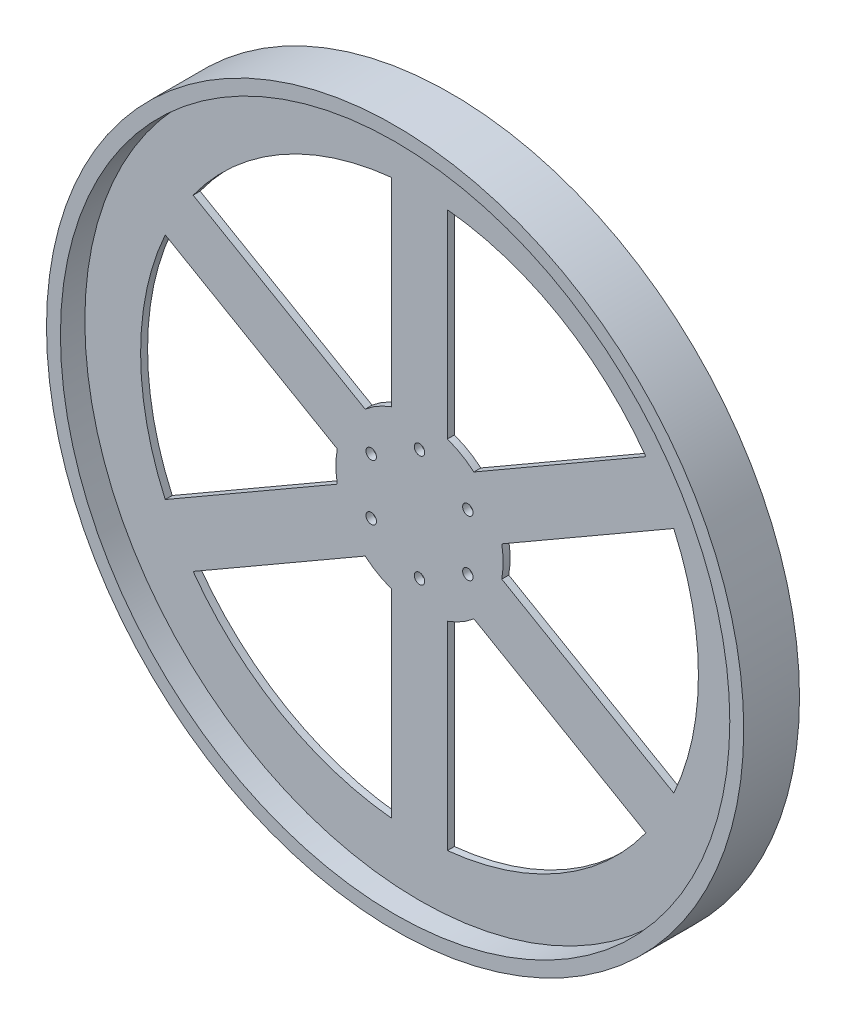
ISO-10303-21;
HEADER;
FILE_DESCRIPTION(('STEP AP214'),'2;1');
FILE_NAME('part.step','',(''),(''),'','','');
FILE_SCHEMA(('AUTOMOTIVE_DESIGN { 1 0 10303 214 1 1 1 1 }'));
ENDSEC;
DATA;
#1=APPLICATION_CONTEXT('core data for automotive mechanical design processes');
#2=APPLICATION_PROTOCOL_DEFINITION('international standard','automotive_design',2000,#1);
#3=PRODUCT_CONTEXT('',#1,'mechanical');
#4=PRODUCT('Part','Part','',(#3));
#5=PRODUCT_RELATED_PRODUCT_CATEGORY('part','',(#4));
#6=PRODUCT_DEFINITION_FORMATION('','',#4);
#7=PRODUCT_DEFINITION_CONTEXT('part definition',#1,'design');
#8=PRODUCT_DEFINITION('design','',#6,#7);
#9=PRODUCT_DEFINITION_SHAPE('','',#8);
#10=(LENGTH_UNIT() NAMED_UNIT(*) SI_UNIT(.MILLI.,.METRE.));
#11=(NAMED_UNIT(*) PLANE_ANGLE_UNIT() SI_UNIT($,.RADIAN.));
#12=(NAMED_UNIT(*) SI_UNIT($,.STERADIAN.) SOLID_ANGLE_UNIT());
#13=UNCERTAINTY_MEASURE_WITH_UNIT(LENGTH_MEASURE(1.E-05),#10,'distance_accuracy_value','');
#14=(GEOMETRIC_REPRESENTATION_CONTEXT(3) GLOBAL_UNCERTAINTY_ASSIGNED_CONTEXT((#13)) GLOBAL_UNIT_ASSIGNED_CONTEXT((#10,
#11,#12)) REPRESENTATION_CONTEXT('',''));
#15=CARTESIAN_POINT('',(0.,0.,0.));
#16=DIRECTION('',(0.,0.,1.));
#17=DIRECTION('',(1.,0.,0.));
#18=AXIS2_PLACEMENT_3D('',#15,#16,#17);
#19=CARTESIAN_POINT('',(0.,0.,-3.175));
#20=DIRECTION('',(0.,0.,1.));
#21=DIRECTION('',(1.,0.,0.));
#22=AXIS2_PLACEMENT_3D('',#19,#20,#21);
#23=CYLINDRICAL_SURFACE('',#22,76.2);
#24=DIRECTION('',(0.,0.,1.));
#25=VECTOR('',#24,1.);
#26=CARTESIAN_POINT('',(-74.9170394666928,-13.9239792281517,-3.175));
#27=LINE('',#26,#25);
#28=CARTESIAN_POINT('',(-74.9170394666928,-13.9239792281517,-3.175));
#29=VERTEX_POINT('',#28);
#30=CARTESIAN_POINT('',(-74.9170394666928,-13.9239792281517,3.175));
#31=VERTEX_POINT('',#30);
#32=EDGE_CURVE('E331',#29,#31,#27,.T.);
#33=ORIENTED_EDGE('',*,*,#32,.T.);
#34=CARTESIAN_POINT('',(0.,0.,3.175));
#35=DIRECTION('',(0.,0.,1.));
#36=DIRECTION('',(1.,0.,0.));
#37=AXIS2_PLACEMENT_3D('',#34,#35,#36);
#38=CIRCLE('',#37,76.2);
#39=CARTESIAN_POINT('',(-74.9170394666927,13.9239792281522,3.175));
#40=VERTEX_POINT('',#39);
#41=EDGE_CURVE('E245',#40,#31,#38,.T.);
#42=ORIENTED_EDGE('',*,*,#41,.F.);
#43=DIRECTION('',(0.,0.,1.));
#44=VECTOR('',#43,1.);
#45=CARTESIAN_POINT('',(-74.9170394666927,13.9239792281522,-3.175));
#46=LINE('',#45,#44);
#47=CARTESIAN_POINT('',(-74.9170394666927,13.9239792281522,-3.175));
#48=VERTEX_POINT('',#47);
#49=EDGE_CURVE('E12',#48,#40,#46,.T.);
#50=ORIENTED_EDGE('',*,*,#49,.F.);
#51=CARTESIAN_POINT('',(0.,0.,-3.175));
#52=DIRECTION('',(0.,0.,1.));
#53=DIRECTION('',(1.,0.,0.));
#54=AXIS2_PLACEMENT_3D('',#51,#52,#53);
#55=CIRCLE('',#54,76.2);
#56=EDGE_CURVE('E294',#48,#29,#55,.T.);
#57=ORIENTED_EDGE('',*,*,#56,.T.);
#58=EDGE_LOOP('',(#33,#42,#50,#57));
#59=FACE_BOUND('',#58,.T.);
#60=ADVANCED_FACE('F41',(#59),#23,.T.);
#61=CARTESIAN_POINT('',(-12.7000000000001,-21.9970452561247,-3.175));
#62=DIRECTION('',(0.500000000000004,0.866025403784436,0.));
#63=DIRECTION('',(-0.866025403784437,0.500000000000004,0.));
#64=AXIS2_PLACEMENT_3D('',#61,#62,#63);
#65=PLANE('',#64);
#66=ORIENTED_EDGE('',*,*,#49,.T.);
#67=DIRECTION('',(-0.866025403784436,0.500000000000004,0.));
#68=VECTOR('',#67,1.);
#69=CARTESIAN_POINT('',(-12.7000000000001,-21.9970452561247,3.175));
#70=LINE('',#69,#68);
#71=CARTESIAN_POINT('',(-231.567836833098,104.366359256417,3.175));
#72=VERTEX_POINT('',#71);
#73=EDGE_CURVE('E275',#40,#72,#70,.T.);
#74=ORIENTED_EDGE('',*,*,#73,.T.);
#75=DIRECTION('',(0.,0.,1.));
#76=VECTOR('',#75,1.);
#77=CARTESIAN_POINT('',(-231.567836833098,104.366359256417,-3.175));
#78=LINE('',#77,#76);
#79=CARTESIAN_POINT('',(-231.567836833098,104.366359256417,-3.175));
#80=VERTEX_POINT('',#79);
#81=EDGE_CURVE('E50',#80,#72,#78,.T.);
#82=ORIENTED_EDGE('',*,*,#81,.F.);
#83=DIRECTION('',(-0.866025403784436,0.500000000000004,0.));
#84=VECTOR('',#83,1.);
#85=CARTESIAN_POINT('',(-12.7000000000001,-21.9970452561247,-3.175));
#86=LINE('',#85,#84);
#87=EDGE_CURVE('E324',#48,#80,#86,.T.);
#88=ORIENTED_EDGE('',*,*,#87,.F.);
#89=EDGE_LOOP('',(#66,#74,#82,#88));
#90=FACE_BOUND('',#89,.T.);
#91=ADVANCED_FACE('F423',(#90),#65,.F.);
#92=CARTESIAN_POINT('',(0.,0.,-3.175));
#93=DIRECTION('',(0.,0.,1.));
#94=DIRECTION('',(1.,0.,0.));
#95=AXIS2_PLACEMENT_3D('',#92,#93,#94);
#96=CYLINDRICAL_SURFACE('',#95,254.);
#97=ORIENTED_EDGE('',*,*,#81,.T.);
#98=CARTESIAN_POINT('',(0.,0.,3.175));
#99=DIRECTION('',(0.,0.,1.));
#100=DIRECTION('',(1.,0.,0.));
#101=AXIS2_PLACEMENT_3D('',#98,#99,#100);
#102=CIRCLE('',#101,254.);
#103=CARTESIAN_POINT('',(-231.567836833099,-104.366359256416,3.175));
#104=VERTEX_POINT('',#103);
#105=EDGE_CURVE('E237',#72,#104,#102,.T.);
#106=ORIENTED_EDGE('',*,*,#105,.T.);
#107=DIRECTION('',(0.,0.,1.));
#108=VECTOR('',#107,1.);
#109=CARTESIAN_POINT('',(-231.567836833099,-104.366359256416,-3.175));
#110=LINE('',#109,#108);
#111=CARTESIAN_POINT('',(-231.567836833099,-104.366359256416,-3.175));
#112=VERTEX_POINT('',#111);
#113=EDGE_CURVE('E329',#112,#104,#110,.T.);
#114=ORIENTED_EDGE('',*,*,#113,.F.);
#115=CARTESIAN_POINT('',(0.,0.,-3.175));
#116=DIRECTION('',(0.,0.,1.));
#117=DIRECTION('',(1.,0.,0.));
#118=AXIS2_PLACEMENT_3D('',#115,#116,#117);
#119=CIRCLE('',#118,254.);
#120=EDGE_CURVE('E64',#80,#112,#119,.T.);
#121=ORIENTED_EDGE('',*,*,#120,.F.);
#122=EDGE_LOOP('',(#97,#106,#114,#121));
#123=FACE_BOUND('',#122,.T.);
#124=ADVANCED_FACE('F430',(#123),#96,.F.);
#125=CARTESIAN_POINT('',(-25.4,1.70513996829964E-13,-3.175));
#126=DIRECTION('',(1.,0.,0.));
#127=DIRECTION('',(0.,1.,0.));
#128=AXIS2_PLACEMENT_3D('',#125,#126,#127);
#129=PLANE('',#128);
#130=DIRECTION('',(0.,0.,1.));
#131=VECTOR('',#130,1.);
#132=CARTESIAN_POINT('',(-25.3999999999996,71.8420489685534,-3.175));
#133=LINE('',#132,#131);
#134=CARTESIAN_POINT('',(-25.3999999999996,71.8420489685534,-3.175));
#135=VERTEX_POINT('',#134);
#136=CARTESIAN_POINT('',(-25.3999999999996,71.8420489685534,3.175));
#137=VERTEX_POINT('',#136);
#138=EDGE_CURVE('E339',#135,#137,#133,.T.);
#139=ORIENTED_EDGE('',*,*,#138,.T.);
#140=DIRECTION('',(0.,1.,0.));
#141=VECTOR('',#140,1.);
#142=CARTESIAN_POINT('',(-25.4,1.70513996829964E-13,3.175));
#143=LINE('',#142,#141);
#144=CARTESIAN_POINT('',(-25.3999999999983,252.726809025082,3.175));
#145=VERTEX_POINT('',#144);
#146=EDGE_CURVE('E264',#137,#145,#143,.T.);
#147=ORIENTED_EDGE('',*,*,#146,.T.);
#148=DIRECTION('',(0.,0.,1.));
#149=VECTOR('',#148,1.);
#150=CARTESIAN_POINT('',(-25.3999999999983,252.726809025082,-3.175));
#151=LINE('',#150,#149);
#152=CARTESIAN_POINT('',(-25.3999999999983,252.726809025082,-3.175));
#153=VERTEX_POINT('',#152);
#154=EDGE_CURVE('E333',#153,#145,#151,.T.);
#155=ORIENTED_EDGE('',*,*,#154,.F.);
#156=DIRECTION('',(0.,1.,0.));
#157=VECTOR('',#156,1.);
#158=CARTESIAN_POINT('',(-25.4,1.70513996829964E-13,-3.175));
#159=LINE('',#158,#157);
#160=EDGE_CURVE('E313',#135,#153,#159,.T.);
#161=ORIENTED_EDGE('',*,*,#160,.F.);
#162=EDGE_LOOP('',(#139,#147,#155,#161));
#163=FACE_BOUND('',#162,.T.);
#164=ADVANCED_FACE('F524',(#163),#129,.F.);
#165=ORIENTED_EDGE('',*,*,#154,.T.);
#166=CARTESIAN_POINT('',(-206.167836833098,148.360449768666,3.175));
#167=VERTEX_POINT('',#166);
#168=EDGE_CURVE('E271',#145,#167,#102,.T.);
#169=ORIENTED_EDGE('',*,*,#168,.T.);
#170=DIRECTION('',(0.,0.,1.));
#171=VECTOR('',#170,1.);
#172=CARTESIAN_POINT('',(-206.167836833098,148.360449768666,-3.175));
#173=LINE('',#172,#171);
#174=CARTESIAN_POINT('',(-206.167836833098,148.360449768666,-3.175));
#175=VERTEX_POINT('',#174);
#176=EDGE_CURVE('E335',#175,#167,#173,.T.);
#177=ORIENTED_EDGE('',*,*,#176,.F.);
#178=EDGE_CURVE('E320',#153,#175,#119,.T.);
#179=ORIENTED_EDGE('',*,*,#178,.F.);
#180=EDGE_LOOP('',(#165,#169,#177,#179));
#181=FACE_BOUND('',#180,.T.);
#182=ADVANCED_FACE('F515',(#181),#96,.F.);
#183=CARTESIAN_POINT('',(12.7000000000001,21.9970452561247,-3.175));
#184=DIRECTION('',(0.500000000000004,0.866025403784436,0.));
#185=DIRECTION('',(-0.866025403784437,0.500000000000004,0.));
#186=AXIS2_PLACEMENT_3D('',#183,#184,#185);
#187=PLANE('',#186);
#188=ORIENTED_EDGE('',*,*,#176,.T.);
#189=DIRECTION('',(-0.866025403784437,0.500000000000004,0.));
#190=VECTOR('',#189,1.);
#191=CARTESIAN_POINT('',(12.7000000000001,21.9970452561247,3.175));
#192=LINE('',#191,#190);
#193=CARTESIAN_POINT('',(-49.5170394666925,57.9180697404016,3.175));
#194=VERTEX_POINT('',#193);
#195=EDGE_CURVE('E268',#194,#167,#192,.T.);
#196=ORIENTED_EDGE('',*,*,#195,.F.);
#197=DIRECTION('',(0.,0.,1.));
#198=VECTOR('',#197,1.);
#199=CARTESIAN_POINT('',(-49.5170394666925,57.9180697404016,-3.175));
#200=LINE('',#199,#198);
#201=CARTESIAN_POINT('',(-49.5170394666925,57.9180697404016,-3.175));
#202=VERTEX_POINT('',#201);
#203=EDGE_CURVE('E337',#202,#194,#200,.T.);
#204=ORIENTED_EDGE('',*,*,#203,.F.);
#205=DIRECTION('',(-0.866025403784437,0.500000000000004,0.));
#206=VECTOR('',#205,1.);
#207=CARTESIAN_POINT('',(12.7000000000001,21.9970452561247,-3.175));
#208=LINE('',#207,#206);
#209=EDGE_CURVE('E317',#202,#175,#208,.T.);
#210=ORIENTED_EDGE('',*,*,#209,.T.);
#211=EDGE_LOOP('',(#188,#196,#204,#210));
#212=FACE_BOUND('',#211,.T.);
#213=ADVANCED_FACE('F455',(#212),#187,.T.);
#214=CARTESIAN_POINT('',(-12.6999999999998,21.9970452561249,-3.175));
#215=DIRECTION('',(0.499999999999992,-0.866025403784443,0.));
#216=DIRECTION('',(0.866025403784443,0.499999999999992,0.));
#217=AXIS2_PLACEMENT_3D('',#214,#215,#216);
#218=PLANE('',#217);
#219=DIRECTION('',(0.,0.,1.));
#220=VECTOR('',#219,1.);
#221=CARTESIAN_POINT('',(49.5170394666932,57.9180697404009,-3.175));
#222=LINE('',#221,#220);
#223=CARTESIAN_POINT('',(49.5170394666932,57.9180697404009,-3.175));
#224=VERTEX_POINT('',#223);
#225=CARTESIAN_POINT('',(49.5170394666932,57.9180697404009,3.175));
#226=VERTEX_POINT('',#225);
#227=EDGE_CURVE('E347',#224,#226,#222,.T.);
#228=ORIENTED_EDGE('',*,*,#227,.T.);
#229=DIRECTION('',(0.866025403784443,0.499999999999992,0.));
#230=VECTOR('',#229,1.);
#231=CARTESIAN_POINT('',(-12.6999999999998,21.9970452561249,3.175));
#232=LINE('',#231,#230);
#233=CARTESIAN_POINT('',(206.1678368331,148.360449768664,3.175));
#234=VERTEX_POINT('',#233);
#235=EDGE_CURVE('E256',#226,#234,#232,.T.);
#236=ORIENTED_EDGE('',*,*,#235,.T.);
#237=DIRECTION('',(0.,0.,1.));
#238=VECTOR('',#237,1.);
#239=CARTESIAN_POINT('',(206.1678368331,148.360449768664,-3.175));
#240=LINE('',#239,#238);
#241=CARTESIAN_POINT('',(206.1678368331,148.360449768664,-3.175));
#242=VERTEX_POINT('',#241);
#243=EDGE_CURVE('E341',#242,#234,#240,.T.);
#244=ORIENTED_EDGE('',*,*,#243,.F.);
#245=DIRECTION('',(0.866025403784443,0.499999999999992,0.));
#246=VECTOR('',#245,1.);
#247=CARTESIAN_POINT('',(-12.6999999999998,21.9970452561249,-3.175));
#248=LINE('',#247,#246);
#249=EDGE_CURVE('E305',#224,#242,#248,.T.);
#250=ORIENTED_EDGE('',*,*,#249,.F.);
#251=EDGE_LOOP('',(#228,#236,#244,#250));
#252=FACE_BOUND('',#251,.T.);
#253=ADVANCED_FACE('F510',(#252),#218,.F.);
#254=ORIENTED_EDGE('',*,*,#243,.T.);
#255=CARTESIAN_POINT('',(25.4000000000016,252.726809025081,3.175));
#256=VERTEX_POINT('',#255);
#257=EDGE_CURVE('E263',#234,#256,#102,.T.);
#258=ORIENTED_EDGE('',*,*,#257,.T.);
#259=DIRECTION('',(0.,0.,1.));
#260=VECTOR('',#259,1.);
#261=CARTESIAN_POINT('',(25.4000000000016,252.726809025081,-3.175));
#262=LINE('',#261,#260);
#263=CARTESIAN_POINT('',(25.4000000000016,252.726809025081,-3.175));
#264=VERTEX_POINT('',#263);
#265=EDGE_CURVE('E343',#264,#256,#262,.T.);
#266=ORIENTED_EDGE('',*,*,#265,.F.);
#267=EDGE_CURVE('E312',#242,#264,#119,.T.);
#268=ORIENTED_EDGE('',*,*,#267,.F.);
#269=EDGE_LOOP('',(#254,#258,#266,#268));
#270=FACE_BOUND('',#269,.T.);
#271=ADVANCED_FACE('F512',(#270),#96,.F.);
#272=CARTESIAN_POINT('',(25.4,-1.60770339868252E-13,-3.175));
#273=DIRECTION('',(1.,0.,0.));
#274=DIRECTION('',(0.,1.,0.));
#275=AXIS2_PLACEMENT_3D('',#272,#273,#274);
#276=PLANE('',#275);
#277=ORIENTED_EDGE('',*,*,#265,.T.);
#278=DIRECTION('',(0.,1.,0.));
#279=VECTOR('',#278,1.);
#280=CARTESIAN_POINT('',(25.4,-1.60770339868252E-13,3.175));
#281=LINE('',#280,#279);
#282=CARTESIAN_POINT('',(25.4000000000005,71.8420489685531,3.175));
#283=VERTEX_POINT('',#282);
#284=EDGE_CURVE('E260',#283,#256,#281,.T.);
#285=ORIENTED_EDGE('',*,*,#284,.F.);
#286=DIRECTION('',(0.,0.,1.));
#287=VECTOR('',#286,1.);
#288=CARTESIAN_POINT('',(25.4000000000005,71.8420489685531,-3.175));
#289=LINE('',#288,#287);
#290=CARTESIAN_POINT('',(25.4000000000005,71.8420489685531,-3.175));
#291=VERTEX_POINT('',#290);
#292=EDGE_CURVE('E345',#291,#283,#289,.T.);
#293=ORIENTED_EDGE('',*,*,#292,.F.);
#294=DIRECTION('',(0.,1.,0.));
#295=VECTOR('',#294,1.);
#296=CARTESIAN_POINT('',(25.4,-1.60770339868252E-13,-3.175));
#297=LINE('',#296,#295);
#298=EDGE_CURVE('E309',#291,#264,#297,.T.);
#299=ORIENTED_EDGE('',*,*,#298,.T.);
#300=EDGE_LOOP('',(#277,#285,#293,#299));
#301=FACE_BOUND('',#300,.T.);
#302=ADVANCED_FACE('F506',(#301),#276,.T.);
#303=CARTESIAN_POINT('',(12.7,21.9970452561248,-3.175));
#304=DIRECTION('',(-0.499999999999998,-0.86602540378444,0.));
#305=DIRECTION('',(0.86602540378444,-0.499999999999998,0.));
#306=AXIS2_PLACEMENT_3D('',#303,#304,#305);
#307=PLANE('',#306);
#308=DIRECTION('',(0.,0.,1.));
#309=VECTOR('',#308,1.);
#310=CARTESIAN_POINT('',(74.9170394666928,-13.9239792281516,-3.175));
#311=LINE('',#310,#309);
#312=CARTESIAN_POINT('',(74.9170394666928,-13.9239792281516,-3.175));
#313=VERTEX_POINT('',#312);
#314=CARTESIAN_POINT('',(74.9170394666928,-13.9239792281516,3.175));
#315=VERTEX_POINT('',#314);
#316=EDGE_CURVE('E355',#313,#315,#311,.T.);
#317=ORIENTED_EDGE('',*,*,#316,.T.);
#318=DIRECTION('',(0.86602540378444,-0.499999999999998,0.));
#319=VECTOR('',#318,1.);
#320=CARTESIAN_POINT('',(12.7,21.9970452561248,3.175));
#321=LINE('',#320,#319);
#322=CARTESIAN_POINT('',(231.567836833099,-104.366359256415,3.175));
#323=VERTEX_POINT('',#322);
#324=EDGE_CURVE('E249',#315,#323,#321,.T.);
#325=ORIENTED_EDGE('',*,*,#324,.T.);
#326=DIRECTION('',(0.,0.,1.));
#327=VECTOR('',#326,1.);
#328=CARTESIAN_POINT('',(231.567836833099,-104.366359256415,-3.175));
#329=LINE('',#328,#327);
#330=CARTESIAN_POINT('',(231.567836833099,-104.366359256415,-3.175));
#331=VERTEX_POINT('',#330);
#332=EDGE_CURVE('E349',#331,#323,#329,.T.);
#333=ORIENTED_EDGE('',*,*,#332,.F.);
#334=DIRECTION('',(0.86602540378444,-0.499999999999998,0.));
#335=VECTOR('',#334,1.);
#336=CARTESIAN_POINT('',(12.7,21.9970452561248,-3.175));
#337=LINE('',#336,#335);
#338=EDGE_CURVE('E298',#313,#331,#337,.T.);
#339=ORIENTED_EDGE('',*,*,#338,.F.);
#340=EDGE_LOOP('',(#317,#325,#333,#339));
#341=FACE_BOUND('',#340,.T.);
#342=ADVANCED_FACE('F520',(#341),#307,.F.);
#343=ORIENTED_EDGE('',*,*,#332,.T.);
#344=CARTESIAN_POINT('',(231.5678368331,104.366359256414,3.175));
#345=VERTEX_POINT('',#344);
#346=EDGE_CURVE('E255',#323,#345,#102,.T.);
#347=ORIENTED_EDGE('',*,*,#346,.T.);
#348=DIRECTION('',(0.,0.,1.));
#349=VECTOR('',#348,1.);
#350=CARTESIAN_POINT('',(231.5678368331,104.366359256414,-3.175));
#351=LINE('',#350,#349);
#352=CARTESIAN_POINT('',(231.5678368331,104.366359256414,-3.175));
#353=VERTEX_POINT('',#352);
#354=EDGE_CURVE('E351',#353,#345,#351,.T.);
#355=ORIENTED_EDGE('',*,*,#354,.F.);
#356=EDGE_CURVE('E304',#331,#353,#119,.T.);
#357=ORIENTED_EDGE('',*,*,#356,.F.);
#358=EDGE_LOOP('',(#343,#347,#355,#357));
#359=FACE_BOUND('',#358,.T.);
#360=ADVANCED_FACE('F492',(#359),#96,.F.);
#361=CARTESIAN_POINT('',(12.6999999999998,-21.9970452561249,-3.175));
#362=DIRECTION('',(0.499999999999992,-0.866025403784443,0.));
#363=DIRECTION('',(0.866025403784443,0.499999999999993,0.));
#364=AXIS2_PLACEMENT_3D('',#361,#362,#363);
#365=PLANE('',#364);
#366=ORIENTED_EDGE('',*,*,#354,.T.);
#367=DIRECTION('',(0.866025403784443,0.499999999999993,0.));
#368=VECTOR('',#367,1.);
#369=CARTESIAN_POINT('',(12.6999999999998,-21.9970452561249,3.175));
#370=LINE('',#369,#368);
#371=CARTESIAN_POINT('',(74.9170394666929,13.9239792281512,3.175));
#372=VERTEX_POINT('',#371);
#373=EDGE_CURVE('E252',#372,#345,#370,.T.);
#374=ORIENTED_EDGE('',*,*,#373,.F.);
#375=DIRECTION('',(0.,0.,1.));
#376=VECTOR('',#375,1.);
#377=CARTESIAN_POINT('',(74.9170394666929,13.9239792281512,-3.175));
#378=LINE('',#377,#376);
#379=CARTESIAN_POINT('',(74.9170394666929,13.9239792281512,-3.175));
#380=VERTEX_POINT('',#379);
#381=EDGE_CURVE('E353',#380,#372,#378,.T.);
#382=ORIENTED_EDGE('',*,*,#381,.F.);
#383=DIRECTION('',(0.866025403784443,0.499999999999993,0.));
#384=VECTOR('',#383,1.);
#385=CARTESIAN_POINT('',(12.6999999999998,-21.9970452561249,-3.175));
#386=LINE('',#385,#384);
#387=EDGE_CURVE('E301',#380,#353,#386,.T.);
#388=ORIENTED_EDGE('',*,*,#387,.T.);
#389=EDGE_LOOP('',(#366,#374,#382,#388));
#390=FACE_BOUND('',#389,.T.);
#391=ADVANCED_FACE('F499',(#390),#365,.T.);
#392=CARTESIAN_POINT('',(12.7,-21.9970452561248,-3.175));
#393=DIRECTION('',(-0.499999999999998,0.86602540378444,0.));
#394=DIRECTION('',(-0.86602540378444,-0.499999999999998,0.));
#395=AXIS2_PLACEMENT_3D('',#392,#393,#394);
#396=PLANE('',#395);
#397=DIRECTION('',(0.,0.,1.));
#398=VECTOR('',#397,1.);
#399=CARTESIAN_POINT('',(-49.5170394666928,-57.9180697404013,-3.175));
#400=LINE('',#399,#398);
#401=CARTESIAN_POINT('',(-49.5170394666928,-57.9180697404013,-3.175));
#402=VERTEX_POINT('',#401);
#403=CARTESIAN_POINT('',(-49.5170394666928,-57.9180697404013,3.175));
#404=VERTEX_POINT('',#403);
#405=EDGE_CURVE('E363',#402,#404,#400,.T.);
#406=ORIENTED_EDGE('',*,*,#405,.T.);
#407=DIRECTION('',(-0.86602540378444,-0.499999999999998,0.));
#408=VECTOR('',#407,1.);
#409=CARTESIAN_POINT('',(12.7,-21.9970452561248,3.175));
#410=LINE('',#409,#408);
#411=CARTESIAN_POINT('',(-206.167836833099,-148.360449768665,3.175));
#412=VERTEX_POINT('',#411);
#413=EDGE_CURVE('E236',#404,#412,#410,.T.);
#414=ORIENTED_EDGE('',*,*,#413,.T.);
#415=DIRECTION('',(0.,0.,1.));
#416=VECTOR('',#415,1.);
#417=CARTESIAN_POINT('',(-206.167836833099,-148.360449768665,-3.175));
#418=LINE('',#417,#416);
#419=CARTESIAN_POINT('',(-206.167836833099,-148.360449768665,-3.175));
#420=VERTEX_POINT('',#419);
#421=EDGE_CURVE('E357',#420,#412,#418,.T.);
#422=ORIENTED_EDGE('',*,*,#421,.F.);
#423=DIRECTION('',(-0.86602540378444,-0.499999999999998,0.));
#424=VECTOR('',#423,1.);
#425=CARTESIAN_POINT('',(12.7,-21.9970452561248,-3.175));
#426=LINE('',#425,#424);
#427=EDGE_CURVE('E286',#402,#420,#426,.T.);
#428=ORIENTED_EDGE('',*,*,#427,.F.);
#429=EDGE_LOOP('',(#406,#414,#422,#428));
#430=FACE_BOUND('',#429,.T.);
#431=ADVANCED_FACE('F487',(#430),#396,.F.);
#432=ORIENTED_EDGE('',*,*,#421,.T.);
#433=CARTESIAN_POINT('',(-25.3999999999999,-252.726809025081,3.175));
#434=VERTEX_POINT('',#433);
#435=EDGE_CURVE('E238',#412,#434,#102,.T.);
#436=ORIENTED_EDGE('',*,*,#435,.T.);
#437=DIRECTION('',(0.,0.,1.));
#438=VECTOR('',#437,1.);
#439=CARTESIAN_POINT('',(-25.3999999999999,-252.726809025081,-3.175));
#440=LINE('',#439,#438);
#441=CARTESIAN_POINT('',(-25.3999999999999,-252.726809025081,-3.175));
#442=VERTEX_POINT('',#441);
#443=EDGE_CURVE('E359',#442,#434,#440,.T.);
#444=ORIENTED_EDGE('',*,*,#443,.F.);
#445=EDGE_CURVE('E287',#420,#442,#119,.T.);
#446=ORIENTED_EDGE('',*,*,#445,.F.);
#447=EDGE_LOOP('',(#432,#436,#444,#446));
#448=FACE_BOUND('',#447,.T.);
#449=ADVANCED_FACE('F479',(#448),#96,.F.);
#450=CARTESIAN_POINT('',(-25.4000000000001,0.,-3.175));
#451=DIRECTION('',(-1.,0.,0.));
#452=DIRECTION('',(0.,-1.,0.));
#453=AXIS2_PLACEMENT_3D('',#450,#451,#452);
#454=PLANE('',#453);
#455=ORIENTED_EDGE('',*,*,#443,.T.);
#456=DIRECTION('',(0.,-1.,0.));
#457=VECTOR('',#456,1.);
#458=CARTESIAN_POINT('',(-25.4000000000001,0.,3.175));
#459=LINE('',#458,#457);
#460=CARTESIAN_POINT('',(-25.4,-71.8420489685532,3.175));
#461=VERTEX_POINT('',#460);
#462=EDGE_CURVE('E244',#461,#434,#459,.T.);
#463=ORIENTED_EDGE('',*,*,#462,.F.);
#464=DIRECTION('',(0.,0.,1.));
#465=VECTOR('',#464,1.);
#466=CARTESIAN_POINT('',(-25.4,-71.8420489685532,-3.175));
#467=LINE('',#466,#465);
#468=CARTESIAN_POINT('',(-25.4,-71.8420489685532,-3.175));
#469=VERTEX_POINT('',#468);
#470=EDGE_CURVE('E361',#469,#461,#467,.T.);
#471=ORIENTED_EDGE('',*,*,#470,.F.);
#472=DIRECTION('',(0.,-1.,0.));
#473=VECTOR('',#472,1.);
#474=CARTESIAN_POINT('',(-25.4000000000001,0.,-3.175));
#475=LINE('',#474,#473);
#476=EDGE_CURVE('E293',#469,#442,#475,.T.);
#477=ORIENTED_EDGE('',*,*,#476,.T.);
#478=EDGE_LOOP('',(#455,#463,#471,#477));
#479=FACE_BOUND('',#478,.T.);
#480=ADVANCED_FACE('F483',(#479),#454,.T.);
#481=CARTESIAN_POINT('',(25.4000000000001,0.,-3.175));
#482=DIRECTION('',(-1.,0.,0.));
#483=DIRECTION('',(0.,-1.,0.));
#484=AXIS2_PLACEMENT_3D('',#481,#482,#483);
#485=PLANE('',#484);
#486=DIRECTION('',(0.,0.,1.));
#487=VECTOR('',#486,1.);
#488=CARTESIAN_POINT('',(25.4000000000001,-71.8420489685532,-3.175));
#489=LINE('',#488,#487);
#490=CARTESIAN_POINT('',(25.4000000000001,-71.8420489685532,-3.175));
#491=VERTEX_POINT('',#490);
#492=CARTESIAN_POINT('',(25.4000000000001,-71.8420489685532,3.175));
#493=VERTEX_POINT('',#492);
#494=EDGE_CURVE('E45',#491,#493,#489,.T.);
#495=ORIENTED_EDGE('',*,*,#494,.T.);
#496=DIRECTION('',(0.,-1.,0.));
#497=VECTOR('',#496,1.);
#498=CARTESIAN_POINT('',(25.4000000000001,0.,3.175));
#499=LINE('',#498,#497);
#500=CARTESIAN_POINT('',(25.4,-252.726809025081,3.175));
#501=VERTEX_POINT('',#500);
#502=EDGE_CURVE('E206',#493,#501,#499,.T.);
#503=ORIENTED_EDGE('',*,*,#502,.T.);
#504=DIRECTION('',(0.,0.,1.));
#505=VECTOR('',#504,1.);
#506=CARTESIAN_POINT('',(25.4,-252.726809025081,-3.175));
#507=LINE('',#506,#505);
#508=CARTESIAN_POINT('',(25.4,-252.726809025081,-3.175));
#509=VERTEX_POINT('',#508);
#510=EDGE_CURVE('E365',#509,#501,#507,.T.);
#511=ORIENTED_EDGE('',*,*,#510,.F.);
#512=DIRECTION('',(0.,-1.,0.));
#513=VECTOR('',#512,1.);
#514=CARTESIAN_POINT('',(25.4000000000001,0.,-3.175));
#515=LINE('',#514,#513);
#516=EDGE_CURVE('E209',#491,#509,#515,.T.);
#517=ORIENTED_EDGE('',*,*,#516,.F.);
#518=EDGE_LOOP('',(#495,#503,#511,#517));
#519=FACE_BOUND('',#518,.T.);
#520=ADVANCED_FACE('F43',(#519),#485,.F.);
#521=ORIENTED_EDGE('',*,*,#510,.T.);
#522=CARTESIAN_POINT('',(206.167836833099,-148.360449768665,3.175));
#523=VERTEX_POINT('',#522);
#524=EDGE_CURVE('E226',#501,#523,#102,.T.);
#525=ORIENTED_EDGE('',*,*,#524,.T.);
#526=DIRECTION('',(0.,0.,1.));
#527=VECTOR('',#526,1.);
#528=CARTESIAN_POINT('',(206.167836833099,-148.360449768665,-3.175));
#529=LINE('',#528,#527);
#530=CARTESIAN_POINT('',(206.167836833099,-148.360449768665,-3.175));
#531=VERTEX_POINT('',#530);
#532=EDGE_CURVE('E367',#531,#523,#529,.T.);
#533=ORIENTED_EDGE('',*,*,#532,.F.);
#534=EDGE_CURVE('E284',#509,#531,#119,.T.);
#535=ORIENTED_EDGE('',*,*,#534,.F.);
#536=EDGE_LOOP('',(#521,#525,#533,#535));
#537=FACE_BOUND('',#536,.T.);
#538=ADVANCED_FACE('F373',(#537),#96,.F.);
#539=CARTESIAN_POINT('',(-12.7,-21.9970452561248,-3.175));
#540=DIRECTION('',(-0.499999999999997,-0.86602540378444,0.));
#541=DIRECTION('',(0.86602540378444,-0.499999999999998,0.));
#542=AXIS2_PLACEMENT_3D('',#539,#540,#541);
#543=PLANE('',#542);
#544=ORIENTED_EDGE('',*,*,#532,.T.);
#545=DIRECTION('',(0.86602540378444,-0.499999999999997,0.));
#546=VECTOR('',#545,1.);
#547=CARTESIAN_POINT('',(-12.7,-21.9970452561248,3.175));
#548=LINE('',#547,#546);
#549=CARTESIAN_POINT('',(49.5170394666929,-57.9180697404013,3.175));
#550=VERTEX_POINT('',#549);
#551=EDGE_CURVE('E221',#550,#523,#548,.T.);
#552=ORIENTED_EDGE('',*,*,#551,.F.);
#553=DIRECTION('',(0.,0.,1.));
#554=VECTOR('',#553,1.);
#555=CARTESIAN_POINT('',(49.5170394666929,-57.9180697404013,-3.175));
#556=LINE('',#555,#554);
#557=CARTESIAN_POINT('',(49.5170394666929,-57.9180697404013,-3.175));
#558=VERTEX_POINT('',#557);
#559=EDGE_CURVE('E213',#558,#550,#556,.T.);
#560=ORIENTED_EDGE('',*,*,#559,.F.);
#561=DIRECTION('',(0.86602540378444,-0.499999999999997,0.));
#562=VECTOR('',#561,1.);
#563=CARTESIAN_POINT('',(-12.7,-21.9970452561248,-3.175));
#564=LINE('',#563,#562);
#565=EDGE_CURVE('E281',#558,#531,#564,.T.);
#566=ORIENTED_EDGE('',*,*,#565,.T.);
#567=EDGE_LOOP('',(#544,#552,#560,#566));
#568=FACE_BOUND('',#567,.T.);
#569=ADVANCED_FACE('F370',(#568),#543,.T.);
#570=CARTESIAN_POINT('',(-12.7,21.9970452561248,-3.175));
#571=DIRECTION('',(-0.499999999999999,0.866025403784439,0.));
#572=DIRECTION('',(-0.86602540378444,-0.499999999999999,0.));
#573=AXIS2_PLACEMENT_3D('',#570,#571,#572);
#574=PLANE('',#573);
#575=ORIENTED_EDGE('',*,*,#113,.T.);
#576=DIRECTION('',(-0.86602540378444,-0.499999999999999,0.));
#577=VECTOR('',#576,1.);
#578=CARTESIAN_POINT('',(-12.7,21.9970452561248,3.175));
#579=LINE('',#578,#577);
#580=EDGE_CURVE('E272',#31,#104,#579,.T.);
#581=ORIENTED_EDGE('',*,*,#580,.F.);
#582=ORIENTED_EDGE('',*,*,#32,.F.);
#583=DIRECTION('',(-0.86602540378444,-0.499999999999999,0.));
#584=VECTOR('',#583,1.);
#585=CARTESIAN_POINT('',(-12.7,21.9970452561248,-3.175));
#586=LINE('',#585,#584);
#587=EDGE_CURVE('E321',#29,#112,#586,.T.);
#588=ORIENTED_EDGE('',*,*,#587,.T.);
#589=EDGE_LOOP('',(#575,#581,#582,#588));
#590=FACE_BOUND('',#589,.T.);
#591=ADVANCED_FACE('F440',(#590),#574,.T.);
#592=ORIENTED_EDGE('',*,*,#203,.T.);
#593=EDGE_CURVE('E267',#137,#194,#38,.T.);
#594=ORIENTED_EDGE('',*,*,#593,.F.);
#595=ORIENTED_EDGE('',*,*,#138,.F.);
#596=EDGE_CURVE('E316',#135,#202,#55,.T.);
#597=ORIENTED_EDGE('',*,*,#596,.T.);
#598=EDGE_LOOP('',(#592,#594,#595,#597));
#599=FACE_BOUND('',#598,.T.);
#600=ADVANCED_FACE('F426',(#599),#23,.T.);
#601=ORIENTED_EDGE('',*,*,#292,.T.);
#602=EDGE_CURVE('E259',#226,#283,#38,.T.);
#603=ORIENTED_EDGE('',*,*,#602,.F.);
#604=ORIENTED_EDGE('',*,*,#227,.F.);
#605=EDGE_CURVE('E308',#224,#291,#55,.T.);
#606=ORIENTED_EDGE('',*,*,#605,.T.);
#607=EDGE_LOOP('',(#601,#603,#604,#606));
#608=FACE_BOUND('',#607,.T.);
#609=ADVANCED_FACE('F439',(#608),#23,.T.);
#610=ORIENTED_EDGE('',*,*,#381,.T.);
#611=EDGE_CURVE('E246',#315,#372,#38,.T.);
#612=ORIENTED_EDGE('',*,*,#611,.F.);
#613=ORIENTED_EDGE('',*,*,#316,.F.);
#614=EDGE_CURVE('E295',#313,#380,#55,.T.);
#615=ORIENTED_EDGE('',*,*,#614,.T.);
#616=EDGE_LOOP('',(#610,#612,#613,#615));
#617=FACE_BOUND('',#616,.T.);
#618=ADVANCED_FACE('F436',(#617),#23,.T.);
#619=ORIENTED_EDGE('',*,*,#470,.T.);
#620=EDGE_CURVE('E241',#404,#461,#38,.T.);
#621=ORIENTED_EDGE('',*,*,#620,.F.);
#622=ORIENTED_EDGE('',*,*,#405,.F.);
#623=EDGE_CURVE('E290',#402,#469,#55,.T.);
#624=ORIENTED_EDGE('',*,*,#623,.T.);
#625=EDGE_LOOP('',(#619,#621,#622,#624));
#626=FACE_BOUND('',#625,.T.);
#627=ADVANCED_FACE('F425',(#626),#23,.T.);
#628=CARTESIAN_POINT('',(0.,0.,-3.175));
#629=DIRECTION('',(0.,0.,1.));
#630=DIRECTION('',(1.,0.,0.));
#631=AXIS2_PLACEMENT_3D('',#628,#629,#630);
#632=CYLINDRICAL_SURFACE('',#631,76.2);
#633=ORIENTED_EDGE('',*,*,#559,.T.);
#634=CARTESIAN_POINT('',(0.,0.,3.175));
#635=DIRECTION('',(0.,0.,1.));
#636=DIRECTION('',(1.,0.,0.));
#637=AXIS2_PLACEMENT_3D('',#634,#635,#636);
#638=CIRCLE('',#637,76.2);
#639=EDGE_CURVE('E216',#493,#550,#638,.T.);
#640=ORIENTED_EDGE('',*,*,#639,.F.);
#641=ORIENTED_EDGE('',*,*,#494,.F.);
#642=CARTESIAN_POINT('',(0.,0.,-3.175));
#643=DIRECTION('',(0.,0.,1.));
#644=DIRECTION('',(1.,0.,0.));
#645=AXIS2_PLACEMENT_3D('',#642,#643,#644);
#646=CIRCLE('',#645,76.2);
#647=EDGE_CURVE('E279',#491,#558,#646,.T.);
#648=ORIENTED_EDGE('',*,*,#647,.T.);
#649=EDGE_LOOP('',(#633,#640,#641,#648));
#650=FACE_BOUND('',#649,.T.);
#651=ADVANCED_FACE('F217',(#650),#632,.T.);
#652=CARTESIAN_POINT('',(0.,0.,-3.175));
#653=DIRECTION('',(0.,0.,1.));
#654=DIRECTION('',(1.,0.,0.));
#655=AXIS2_PLACEMENT_3D('',#652,#653,#654);
#656=PLANE('',#655);
#657=CARTESIAN_POINT('',(0.,50.8,-3.175));
#658=DIRECTION('',(0.,0.,1.));
#659=DIRECTION('',(1.,0.,0.));
#660=AXIS2_PLACEMENT_3D('',#657,#658,#659);
#661=CIRCLE('',#660,4.7625);
#662=CARTESIAN_POINT('',(4.7625,50.8,-3.175));
#663=VERTEX_POINT('',#662);
#664=EDGE_CURVE('E649',#663,#663,#661,.T.);
#665=ORIENTED_EDGE('',*,*,#664,.T.);
#666=EDGE_LOOP('',(#665));
#667=FACE_BOUND('',#666,.T.);
#668=CARTESIAN_POINT('',(-43.9940905122484,25.3999999999981,-3.175));
#669=DIRECTION('',(0.,0.,1.));
#670=DIRECTION('',(1.,0.,0.));
#671=AXIS2_PLACEMENT_3D('',#668,#669,#670);
#672=CIRCLE('',#671,4.7625);
#673=CARTESIAN_POINT('',(-39.2315905122484,25.3999999999981,-3.175));
#674=VERTEX_POINT('',#673);
#675=EDGE_CURVE('E654',#674,#674,#672,.T.);
#676=ORIENTED_EDGE('',*,*,#675,.T.);
#677=EDGE_LOOP('',(#676));
#678=FACE_BOUND('',#677,.T.);
#679=CARTESIAN_POINT('',(-43.9940905122462,-25.4000000000019,-3.175));
#680=DIRECTION('',(0.,0.,1.));
#681=DIRECTION('',(1.,0.,0.));
#682=AXIS2_PLACEMENT_3D('',#679,#680,#681);
#683=CIRCLE('',#682,4.7625);
#684=CARTESIAN_POINT('',(-39.2315905122462,-25.4000000000019,-3.175));
#685=VERTEX_POINT('',#684);
#686=EDGE_CURVE('E691',#685,#685,#683,.T.);
#687=ORIENTED_EDGE('',*,*,#686,.T.);
#688=EDGE_LOOP('',(#687));
#689=FACE_BOUND('',#688,.T.);
#690=CARTESIAN_POINT('',(4.31902610571423E-12,-50.8,-3.175));
#691=DIRECTION('',(0.,0.,1.));
#692=DIRECTION('',(1.,0.,0.));
#693=AXIS2_PLACEMENT_3D('',#690,#691,#692);
#694=CIRCLE('',#693,4.7625);
#695=CARTESIAN_POINT('',(4.76250000000432,-50.8,-3.175));
#696=VERTEX_POINT('',#695);
#697=EDGE_CURVE('E694',#696,#696,#694,.T.);
#698=ORIENTED_EDGE('',*,*,#697,.T.);
#699=EDGE_LOOP('',(#698));
#700=FACE_BOUND('',#699,.T.);
#701=CARTESIAN_POINT('',(43.9940905122527,-25.3999999999981,-3.175));
#702=DIRECTION('',(0.,0.,1.));
#703=DIRECTION('',(1.,0.,0.));
#704=AXIS2_PLACEMENT_3D('',#701,#702,#703);
#705=CIRCLE('',#704,4.7625);
#706=CARTESIAN_POINT('',(48.7565905122527,-25.3999999999981,-3.175));
#707=VERTEX_POINT('',#706);
#708=EDGE_CURVE('E697',#707,#707,#705,.T.);
#709=ORIENTED_EDGE('',*,*,#708,.T.);
#710=EDGE_LOOP('',(#709));
#711=FACE_BOUND('',#710,.T.);
#712=CARTESIAN_POINT('',(43.9940905122506,25.4000000000019,-3.175));
#713=DIRECTION('',(0.,0.,1.));
#714=DIRECTION('',(1.,0.,0.));
#715=AXIS2_PLACEMENT_3D('',#712,#713,#714);
#716=CIRCLE('',#715,4.7625);
#717=CARTESIAN_POINT('',(48.7565905122506,25.4000000000019,-3.175));
#718=VERTEX_POINT('',#717);
#719=EDGE_CURVE('E700',#718,#718,#716,.T.);
#720=ORIENTED_EDGE('',*,*,#719,.T.);
#721=EDGE_LOOP('',(#720));
#722=FACE_BOUND('',#721,.T.);
#723=ORIENTED_EDGE('',*,*,#516,.T.);
#724=ORIENTED_EDGE('',*,*,#534,.T.);
#725=ORIENTED_EDGE('',*,*,#565,.F.);
#726=ORIENTED_EDGE('',*,*,#647,.F.);
#727=EDGE_LOOP('',(#723,#724,#725,#726));
#728=FACE_BOUND('',#727,.T.);
#729=ORIENTED_EDGE('',*,*,#427,.T.);
#730=ORIENTED_EDGE('',*,*,#445,.T.);
#731=ORIENTED_EDGE('',*,*,#476,.F.);
#732=ORIENTED_EDGE('',*,*,#623,.F.);
#733=EDGE_LOOP('',(#729,#730,#731,#732));
#734=FACE_BOUND('',#733,.T.);
#735=ORIENTED_EDGE('',*,*,#338,.T.);
#736=ORIENTED_EDGE('',*,*,#356,.T.);
#737=ORIENTED_EDGE('',*,*,#387,.F.);
#738=ORIENTED_EDGE('',*,*,#614,.F.);
#739=EDGE_LOOP('',(#735,#736,#737,#738));
#740=FACE_BOUND('',#739,.T.);
#741=ORIENTED_EDGE('',*,*,#249,.T.);
#742=ORIENTED_EDGE('',*,*,#267,.T.);
#743=ORIENTED_EDGE('',*,*,#298,.F.);
#744=ORIENTED_EDGE('',*,*,#605,.F.);
#745=EDGE_LOOP('',(#741,#742,#743,#744));
#746=FACE_BOUND('',#745,.T.);
#747=ORIENTED_EDGE('',*,*,#160,.T.);
#748=ORIENTED_EDGE('',*,*,#178,.T.);
#749=ORIENTED_EDGE('',*,*,#209,.F.);
#750=ORIENTED_EDGE('',*,*,#596,.F.);
#751=EDGE_LOOP('',(#747,#748,#749,#750));
#752=FACE_BOUND('',#751,.T.);
#753=ORIENTED_EDGE('',*,*,#56,.F.);
#754=ORIENTED_EDGE('',*,*,#87,.T.);
#755=ORIENTED_EDGE('',*,*,#120,.T.);
#756=ORIENTED_EDGE('',*,*,#587,.F.);
#757=EDGE_LOOP('',(#753,#754,#755,#756));
#758=FACE_BOUND('',#757,.T.);
#759=CARTESIAN_POINT('',(0.,0.,-3.175));
#760=DIRECTION('',(0.,0.,1.));
#761=DIRECTION('',(1.,0.,0.));
#762=AXIS2_PLACEMENT_3D('',#759,#760,#761);
#763=CIRCLE('',#762,304.8);
#764=CARTESIAN_POINT('',(304.8,0.,-3.175));
#765=VERTEX_POINT('',#764);
#766=EDGE_CURVE('E214',#765,#765,#763,.T.);
#767=ORIENTED_EDGE('',*,*,#766,.F.);
#768=EDGE_LOOP('',(#767));
#769=FACE_BOUND('',#768,.T.);
#770=ADVANCED_FACE('F375',(#667,#678,#689,#700,#711,#722,#728,#734,#740,#746,#752,#758,#769),
#656,.F.);
#771=CARTESIAN_POINT('',(0.,0.,3.175));
#772=DIRECTION('',(0.,0.,1.));
#773=DIRECTION('',(1.,0.,0.));
#774=AXIS2_PLACEMENT_3D('',#771,#772,#773);
#775=PLANE('',#774);
#776=CARTESIAN_POINT('',(0.,50.8,3.175));
#777=DIRECTION('',(0.,0.,1.));
#778=DIRECTION('',(1.,0.,0.));
#779=AXIS2_PLACEMENT_3D('',#776,#777,#778);
#780=CIRCLE('',#779,4.7625);
#781=CARTESIAN_POINT('',(4.7625,50.8,3.175));
#782=VERTEX_POINT('',#781);
#783=EDGE_CURVE('E703',#782,#782,#780,.T.);
#784=ORIENTED_EDGE('',*,*,#783,.F.);
#785=EDGE_LOOP('',(#784));
#786=FACE_BOUND('',#785,.T.);
#787=CARTESIAN_POINT('',(-43.9940905122484,25.3999999999981,3.175));
#788=DIRECTION('',(0.,0.,1.));
#789=DIRECTION('',(1.,0.,0.));
#790=AXIS2_PLACEMENT_3D('',#787,#788,#789);
#791=CIRCLE('',#790,4.7625);
#792=CARTESIAN_POINT('',(-39.2315905122484,25.3999999999981,3.175));
#793=VERTEX_POINT('',#792);
#794=EDGE_CURVE('E709',#793,#793,#791,.T.);
#795=ORIENTED_EDGE('',*,*,#794,.F.);
#796=EDGE_LOOP('',(#795));
#797=FACE_BOUND('',#796,.T.);
#798=CARTESIAN_POINT('',(-43.9940905122462,-25.4000000000019,3.175));
#799=DIRECTION('',(0.,0.,1.));
#800=DIRECTION('',(1.,0.,0.));
#801=AXIS2_PLACEMENT_3D('',#798,#799,#800);
#802=CIRCLE('',#801,4.7625);
#803=CARTESIAN_POINT('',(-39.2315905122462,-25.4000000000019,3.175));
#804=VERTEX_POINT('',#803);
#805=EDGE_CURVE('E704',#804,#804,#802,.T.);
#806=ORIENTED_EDGE('',*,*,#805,.F.);
#807=EDGE_LOOP('',(#806));
#808=FACE_BOUND('',#807,.T.);
#809=CARTESIAN_POINT('',(4.31902610571423E-12,-50.8,3.175));
#810=DIRECTION('',(0.,0.,1.));
#811=DIRECTION('',(1.,0.,0.));
#812=AXIS2_PLACEMENT_3D('',#809,#810,#811);
#813=CIRCLE('',#812,4.7625);
#814=CARTESIAN_POINT('',(4.76250000000432,-50.8,3.175));
#815=VERTEX_POINT('',#814);
#816=EDGE_CURVE('E708',#815,#815,#813,.T.);
#817=ORIENTED_EDGE('',*,*,#816,.F.);
#818=EDGE_LOOP('',(#817));
#819=FACE_BOUND('',#818,.T.);
#820=CARTESIAN_POINT('',(43.9940905122527,-25.3999999999981,3.175));
#821=DIRECTION('',(0.,0.,1.));
#822=DIRECTION('',(1.,0.,0.));
#823=AXIS2_PLACEMENT_3D('',#820,#821,#822);
#824=CIRCLE('',#823,4.7625);
#825=CARTESIAN_POINT('',(48.7565905122527,-25.3999999999981,3.175));
#826=VERTEX_POINT('',#825);
#827=EDGE_CURVE('E716',#826,#826,#824,.T.);
#828=ORIENTED_EDGE('',*,*,#827,.F.);
#829=EDGE_LOOP('',(#828));
#830=FACE_BOUND('',#829,.T.);
#831=CARTESIAN_POINT('',(43.9940905122506,25.4000000000019,3.175));
#832=DIRECTION('',(0.,0.,1.));
#833=DIRECTION('',(1.,0.,0.));
#834=AXIS2_PLACEMENT_3D('',#831,#832,#833);
#835=CIRCLE('',#834,4.7625);
#836=CARTESIAN_POINT('',(48.7565905122506,25.4000000000019,3.175));
#837=VERTEX_POINT('',#836);
#838=EDGE_CURVE('E719',#837,#837,#835,.T.);
#839=ORIENTED_EDGE('',*,*,#838,.F.);
#840=EDGE_LOOP('',(#839));
#841=FACE_BOUND('',#840,.T.);
#842=ORIENTED_EDGE('',*,*,#502,.F.);
#843=ORIENTED_EDGE('',*,*,#639,.T.);
#844=ORIENTED_EDGE('',*,*,#551,.T.);
#845=ORIENTED_EDGE('',*,*,#524,.F.);
#846=EDGE_LOOP('',(#842,#843,#844,#845));
#847=FACE_BOUND('',#846,.T.);
#848=ORIENTED_EDGE('',*,*,#413,.F.);
#849=ORIENTED_EDGE('',*,*,#620,.T.);
#850=ORIENTED_EDGE('',*,*,#462,.T.);
#851=ORIENTED_EDGE('',*,*,#435,.F.);
#852=EDGE_LOOP('',(#848,#849,#850,#851));
#853=FACE_BOUND('',#852,.T.);
#854=ORIENTED_EDGE('',*,*,#324,.F.);
#855=ORIENTED_EDGE('',*,*,#611,.T.);
#856=ORIENTED_EDGE('',*,*,#373,.T.);
#857=ORIENTED_EDGE('',*,*,#346,.F.);
#858=EDGE_LOOP('',(#854,#855,#856,#857));
#859=FACE_BOUND('',#858,.T.);
#860=ORIENTED_EDGE('',*,*,#235,.F.);
#861=ORIENTED_EDGE('',*,*,#602,.T.);
#862=ORIENTED_EDGE('',*,*,#284,.T.);
#863=ORIENTED_EDGE('',*,*,#257,.F.);
#864=EDGE_LOOP('',(#860,#861,#862,#863));
#865=FACE_BOUND('',#864,.T.);
#866=ORIENTED_EDGE('',*,*,#146,.F.);
#867=ORIENTED_EDGE('',*,*,#593,.T.);
#868=ORIENTED_EDGE('',*,*,#195,.T.);
#869=ORIENTED_EDGE('',*,*,#168,.F.);
#870=EDGE_LOOP('',(#866,#867,#868,#869));
#871=FACE_BOUND('',#870,.T.);
#872=ORIENTED_EDGE('',*,*,#41,.T.);
#873=ORIENTED_EDGE('',*,*,#580,.T.);
#874=ORIENTED_EDGE('',*,*,#105,.F.);
#875=ORIENTED_EDGE('',*,*,#73,.F.);
#876=EDGE_LOOP('',(#872,#873,#874,#875));
#877=FACE_BOUND('',#876,.T.);
#878=CARTESIAN_POINT('',(0.,0.,3.175));
#879=DIRECTION('',(0.,0.,1.));
#880=DIRECTION('',(1.,0.,0.));
#881=AXIS2_PLACEMENT_3D('',#878,#879,#880);
#882=CIRCLE('',#881,304.8);
#883=CARTESIAN_POINT('',(304.8,0.,3.175));
#884=VERTEX_POINT('',#883);
#885=EDGE_CURVE('E227',#884,#884,#882,.T.);
#886=ORIENTED_EDGE('',*,*,#885,.T.);
#887=EDGE_LOOP('',(#886));
#888=FACE_BOUND('',#887,.T.);
#889=ADVANCED_FACE('F223',(#786,#797,#808,#819,#830,#841,#847,#853,#859,#865,#871,#877,#888),
#775,.T.);
#890=CARTESIAN_POINT('',(0.,0.,-25.4));
#891=DIRECTION('',(0.,0.,1.));
#892=DIRECTION('',(1.,0.,0.));
#893=AXIS2_PLACEMENT_3D('',#890,#891,#892);
#894=CYLINDRICAL_SURFACE('',#893,304.8);
#895=CARTESIAN_POINT('',(0.,0.,-25.4));
#896=DIRECTION('',(0.,0.,1.));
#897=DIRECTION('',(1.,0.,0.));
#898=AXIS2_PLACEMENT_3D('',#895,#896,#897);
#899=CIRCLE('',#898,304.8);
#900=CARTESIAN_POINT('',(304.8,0.,-25.4));
#901=VERTEX_POINT('',#900);
#902=EDGE_CURVE('E651',#901,#901,#899,.T.);
#903=ORIENTED_EDGE('',*,*,#902,.F.);
#904=EDGE_LOOP('',(#903));
#905=FACE_BOUND('',#904,.T.);
#906=ORIENTED_EDGE('',*,*,#766,.T.);
#907=EDGE_LOOP('',(#906));
#908=FACE_BOUND('',#907,.T.);
#909=ADVANCED_FACE('F401',(#905,#908),#894,.F.);
#910=CARTESIAN_POINT('',(0.,0.,-25.4));
#911=DIRECTION('',(0.,0.,1.));
#912=DIRECTION('',(1.,0.,0.));
#913=AXIS2_PLACEMENT_3D('',#910,#911,#912);
#914=CYLINDRICAL_SURFACE('',#913,317.5);
#915=CARTESIAN_POINT('',(0.,0.,-25.4));
#916=DIRECTION('',(0.,0.,1.));
#917=DIRECTION('',(1.,0.,0.));
#918=AXIS2_PLACEMENT_3D('',#915,#916,#917);
#919=CIRCLE('',#918,317.5);
#920=CARTESIAN_POINT('',(317.5,0.,-25.4));
#921=VERTEX_POINT('',#920);
#922=EDGE_CURVE('E230',#921,#921,#919,.T.);
#923=ORIENTED_EDGE('',*,*,#922,.T.);
#924=EDGE_LOOP('',(#923));
#925=FACE_BOUND('',#924,.T.);
#926=CARTESIAN_POINT('',(0.,0.,25.4));
#927=DIRECTION('',(0.,0.,1.));
#928=DIRECTION('',(1.,0.,0.));
#929=AXIS2_PLACEMENT_3D('',#926,#927,#928);
#930=CIRCLE('',#929,317.5);
#931=CARTESIAN_POINT('',(317.5,0.,25.4));
#932=VERTEX_POINT('',#931);
#933=EDGE_CURVE('E644',#932,#932,#930,.T.);
#934=ORIENTED_EDGE('',*,*,#933,.F.);
#935=EDGE_LOOP('',(#934));
#936=FACE_BOUND('',#935,.T.);
#937=ADVANCED_FACE('F403',(#925,#936),#914,.T.);
#938=CARTESIAN_POINT('',(0.,0.,-25.4));
#939=DIRECTION('',(0.,0.,1.));
#940=DIRECTION('',(1.,0.,0.));
#941=AXIS2_PLACEMENT_3D('',#938,#939,#940);
#942=PLANE('',#941);
#943=ORIENTED_EDGE('',*,*,#902,.T.);
#944=EDGE_LOOP('',(#943));
#945=FACE_BOUND('',#944,.T.);
#946=ORIENTED_EDGE('',*,*,#922,.F.);
#947=EDGE_LOOP('',(#946));
#948=FACE_BOUND('',#947,.T.);
#949=ADVANCED_FACE('F411',(#945,#948),#942,.F.);
#950=ORIENTED_EDGE('',*,*,#885,.F.);
#951=EDGE_LOOP('',(#950));
#952=FACE_BOUND('',#951,.T.);
#953=CARTESIAN_POINT('',(0.,0.,25.4));
#954=DIRECTION('',(0.,0.,1.));
#955=DIRECTION('',(1.,0.,0.));
#956=AXIS2_PLACEMENT_3D('',#953,#954,#955);
#957=CIRCLE('',#956,304.8);
#958=CARTESIAN_POINT('',(304.8,0.,25.4));
#959=VERTEX_POINT('',#958);
#960=EDGE_CURVE('E647',#959,#959,#957,.T.);
#961=ORIENTED_EDGE('',*,*,#960,.T.);
#962=EDGE_LOOP('',(#961));
#963=FACE_BOUND('',#962,.T.);
#964=ADVANCED_FACE('F406',(#952,#963),#894,.F.);
#965=CARTESIAN_POINT('',(0.,0.,25.4));
#966=DIRECTION('',(0.,0.,1.));
#967=DIRECTION('',(1.,0.,0.));
#968=AXIS2_PLACEMENT_3D('',#965,#966,#967);
#969=PLANE('',#968);
#970=ORIENTED_EDGE('',*,*,#933,.T.);
#971=EDGE_LOOP('',(#970));
#972=FACE_BOUND('',#971,.T.);
#973=ORIENTED_EDGE('',*,*,#960,.F.);
#974=EDGE_LOOP('',(#973));
#975=FACE_BOUND('',#974,.T.);
#976=ADVANCED_FACE('F420',(#972,#975),#969,.T.);
#977=CARTESIAN_POINT('',(43.9940905122506,25.4000000000019,-25.4));
#978=DIRECTION('',(0.,0.,1.));
#979=DIRECTION('',(1.,0.,0.));
#980=AXIS2_PLACEMENT_3D('',#977,#978,#979);
#981=CYLINDRICAL_SURFACE('',#980,4.7625);
#982=ORIENTED_EDGE('',*,*,#838,.T.);
#983=EDGE_LOOP('',(#982));
#984=FACE_BOUND('',#983,.T.);
#985=ORIENTED_EDGE('',*,*,#719,.F.);
#986=EDGE_LOOP('',(#985));
#987=FACE_BOUND('',#986,.T.);
#988=ADVANCED_FACE('F576',(#984,#987),#981,.F.);
#989=CARTESIAN_POINT('',(43.9940905122527,-25.3999999999981,-25.4));
#990=DIRECTION('',(0.,0.,1.));
#991=DIRECTION('',(1.,0.,0.));
#992=AXIS2_PLACEMENT_3D('',#989,#990,#991);
#993=CYLINDRICAL_SURFACE('',#992,4.7625);
#994=ORIENTED_EDGE('',*,*,#827,.T.);
#995=EDGE_LOOP('',(#994));
#996=FACE_BOUND('',#995,.T.);
#997=ORIENTED_EDGE('',*,*,#708,.F.);
#998=EDGE_LOOP('',(#997));
#999=FACE_BOUND('',#998,.T.);
#1000=ADVANCED_FACE('F581',(#996,#999),#993,.F.);
#1001=CARTESIAN_POINT('',(4.31902610571423E-12,-50.8,-25.4));
#1002=DIRECTION('',(0.,0.,1.));
#1003=DIRECTION('',(1.,0.,0.));
#1004=AXIS2_PLACEMENT_3D('',#1001,#1002,#1003);
#1005=CYLINDRICAL_SURFACE('',#1004,4.7625);
#1006=ORIENTED_EDGE('',*,*,#816,.T.);
#1007=EDGE_LOOP('',(#1006));
#1008=FACE_BOUND('',#1007,.T.);
#1009=ORIENTED_EDGE('',*,*,#697,.F.);
#1010=EDGE_LOOP('',(#1009));
#1011=FACE_BOUND('',#1010,.T.);
#1012=ADVANCED_FACE('F593',(#1008,#1011),#1005,.F.);
#1013=CARTESIAN_POINT('',(-43.9940905122462,-25.4000000000019,-25.4));
#1014=DIRECTION('',(0.,0.,1.));
#1015=DIRECTION('',(1.,0.,0.));
#1016=AXIS2_PLACEMENT_3D('',#1013,#1014,#1015);
#1017=CYLINDRICAL_SURFACE('',#1016,4.7625);
#1018=ORIENTED_EDGE('',*,*,#805,.T.);
#1019=EDGE_LOOP('',(#1018));
#1020=FACE_BOUND('',#1019,.T.);
#1021=ORIENTED_EDGE('',*,*,#686,.F.);
#1022=EDGE_LOOP('',(#1021));
#1023=FACE_BOUND('',#1022,.T.);
#1024=ADVANCED_FACE('F603',(#1020,#1023),#1017,.F.);
#1025=CARTESIAN_POINT('',(-43.9940905122484,25.3999999999981,-25.4));
#1026=DIRECTION('',(0.,0.,1.));
#1027=DIRECTION('',(1.,0.,0.));
#1028=AXIS2_PLACEMENT_3D('',#1025,#1026,#1027);
#1029=CYLINDRICAL_SURFACE('',#1028,4.7625);
#1030=ORIENTED_EDGE('',*,*,#794,.T.);
#1031=EDGE_LOOP('',(#1030));
#1032=FACE_BOUND('',#1031,.T.);
#1033=ORIENTED_EDGE('',*,*,#675,.F.);
#1034=EDGE_LOOP('',(#1033));
#1035=FACE_BOUND('',#1034,.T.);
#1036=ADVANCED_FACE('F613',(#1032,#1035),#1029,.F.);
#1037=CARTESIAN_POINT('',(0.,50.8,-25.4));
#1038=DIRECTION('',(0.,0.,1.));
#1039=DIRECTION('',(1.,0.,0.));
#1040=AXIS2_PLACEMENT_3D('',#1037,#1038,#1039);
#1041=CYLINDRICAL_SURFACE('',#1040,4.7625);
#1042=ORIENTED_EDGE('',*,*,#783,.T.);
#1043=EDGE_LOOP('',(#1042));
#1044=FACE_BOUND('',#1043,.T.);
#1045=ORIENTED_EDGE('',*,*,#664,.F.);
#1046=EDGE_LOOP('',(#1045));
#1047=FACE_BOUND('',#1046,.T.);
#1048=ADVANCED_FACE('F623',(#1044,#1047),#1041,.F.);
#1049=CLOSED_SHELL('',(#60,#91,#124,#164,#182,#213,#253,#271,#302,#342,#360,#391,#431,#449,#480,
#520,#538,#569,#591,#600,#609,#618,#627,#651,#770,#889,#909,#937,#949,#964,#976,#988,#1000,
#1012,#1024,#1036,#1048));
#1050=MANIFOLD_SOLID_BREP('B2',#1049);
#1051=ADVANCED_BREP_SHAPE_REPRESENTATION('',(#18,#1050),#14);
#1052=SHAPE_DEFINITION_REPRESENTATION(#9,#1051);
ENDSEC;
END-ISO-10303-21;
